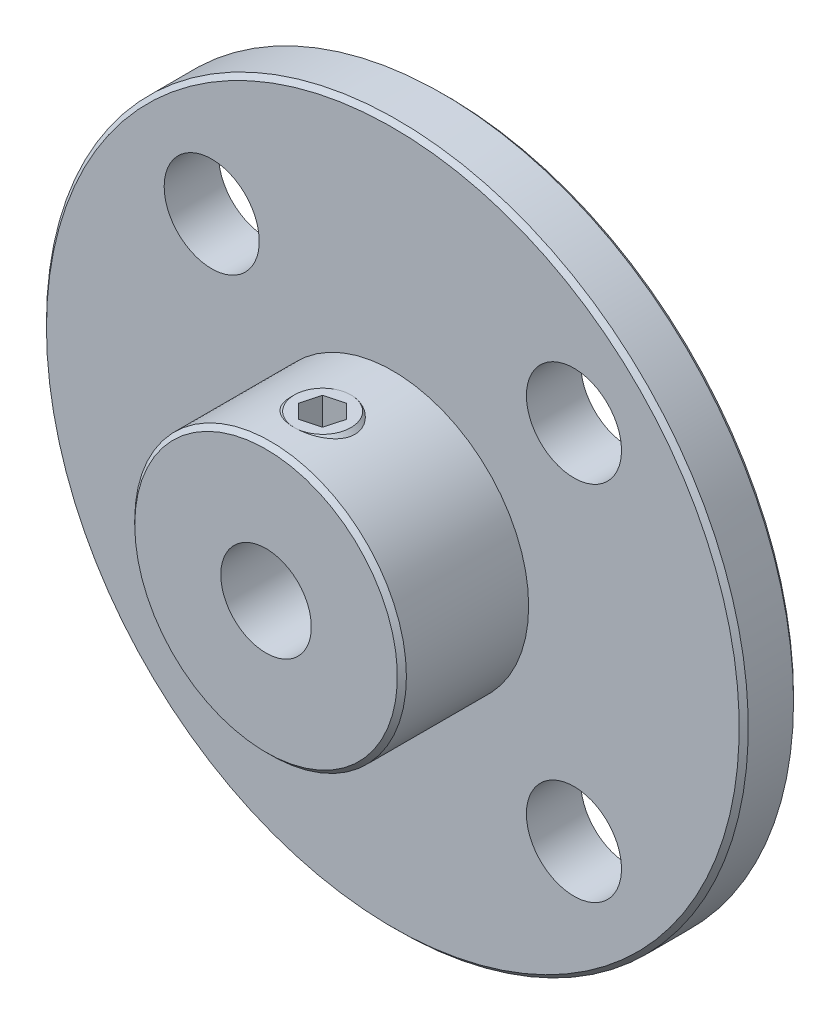
ISO-10303-21;
HEADER;
FILE_DESCRIPTION(('STEP AP214'),'2;1');
FILE_NAME('part.step','',(''),(''),'','','');
FILE_SCHEMA(('AUTOMOTIVE_DESIGN { 1 0 10303 214 1 1 1 1 }'));
ENDSEC;
DATA;
#1=APPLICATION_CONTEXT('core data for automotive mechanical design processes');
#2=APPLICATION_PROTOCOL_DEFINITION('international standard','automotive_design',2000,#1);
#3=PRODUCT_CONTEXT('',#1,'mechanical');
#4=PRODUCT('Part','Part','',(#3));
#5=PRODUCT_RELATED_PRODUCT_CATEGORY('part','',(#4));
#6=PRODUCT_DEFINITION_FORMATION('','',#4);
#7=PRODUCT_DEFINITION_CONTEXT('part definition',#1,'design');
#8=PRODUCT_DEFINITION('design','',#6,#7);
#9=PRODUCT_DEFINITION_SHAPE('','',#8);
#10=(LENGTH_UNIT() NAMED_UNIT(*) SI_UNIT(.MILLI.,.METRE.));
#11=(NAMED_UNIT(*) PLANE_ANGLE_UNIT() SI_UNIT($,.RADIAN.));
#12=(NAMED_UNIT(*) SI_UNIT($,.STERADIAN.) SOLID_ANGLE_UNIT());
#13=UNCERTAINTY_MEASURE_WITH_UNIT(LENGTH_MEASURE(1.E-05),#10,'distance_accuracy_value','');
#14=(GEOMETRIC_REPRESENTATION_CONTEXT(3) GLOBAL_UNCERTAINTY_ASSIGNED_CONTEXT((#13)) GLOBAL_UNIT_ASSIGNED_CONTEXT((#10,
#11,#12)) REPRESENTATION_CONTEXT('',''));
#15=CARTESIAN_POINT('',(0.,0.,0.));
#16=DIRECTION('',(0.,0.,1.));
#17=DIRECTION('',(1.,0.,0.));
#18=AXIS2_PLACEMENT_3D('',#15,#16,#17);
#19=CARTESIAN_POINT('',(0.,6.,5.50000000000001));
#20=DIRECTION('',(0.,-1.,0.));
#21=DIRECTION('',(0.,0.,-1.));
#22=AXIS2_PLACEMENT_3D('',#19,#20,#21);
#23=CYLINDRICAL_SURFACE('',#22,1.5);
#24=CARTESIAN_POINT('',(0.,5.75,5.50000000000001));
#25=DIRECTION('',(0.,1.,0.));
#26=DIRECTION('',(0.,0.,1.));
#27=AXIS2_PLACEMENT_3D('',#24,#25,#26);
#28=CIRCLE('',#27,1.5);
#29=CARTESIAN_POINT('',(0.,5.75,7.00000000000001));
#30=VERTEX_POINT('',#29);
#31=EDGE_CURVE('E12',#30,#30,#28,.F.);
#32=ORIENTED_EDGE('',*,*,#31,.T.);
#33=EDGE_LOOP('',(#32));
#34=FACE_BOUND('',#33,.T.);
#35=CARTESIAN_POINT('',(0.,1.5,5.50000000000001));
#36=DIRECTION('',(0.,1.,0.));
#37=DIRECTION('',(0.,0.,1.));
#38=AXIS2_PLACEMENT_3D('',#35,#36,#37);
#39=CIRCLE('',#38,1.5);
#40=CARTESIAN_POINT('',(0.,1.5,7.00000000000001));
#41=VERTEX_POINT('',#40);
#42=EDGE_CURVE('E150',#41,#41,#39,.T.);
#43=ORIENTED_EDGE('',*,*,#42,.T.);
#44=EDGE_LOOP('',(#43));
#45=FACE_BOUND('',#44,.T.);
#46=ADVANCED_FACE('F48',(#34,#45),#23,.T.);
#47=CARTESIAN_POINT('',(0.,6.,5.50000000000001));
#48=DIRECTION('',(0.,1.,0.));
#49=DIRECTION('',(0.,0.,1.));
#50=AXIS2_PLACEMENT_3D('',#47,#48,#49);
#51=PLANE('',#50);
#52=DIRECTION('',(0.261011592838952,0.,-0.965335666182325));
#53=VECTOR('',#52,1.);
#54=CARTESIAN_POINT('',(0.610980414596356,6.,6.11376129967575));
#55=LINE('',#54,#53);
#56=CARTESIAN_POINT('',(0.610980414596356,6.,6.11376129967575));
#57=VERTEX_POINT('',#56);
#58=CARTESIAN_POINT('',(0.837023084677128,6.,5.27775608958268));
#59=VERTEX_POINT('',#58);
#60=EDGE_CURVE('E63',#57,#59,#55,.T.);
#61=ORIENTED_EDGE('',*,*,#60,.F.);
#62=DIRECTION('',(0.966511006512544,0.,-0.25662516301039));
#63=VECTOR('',#62,1.);
#64=CARTESIAN_POINT('',(-0.226042670080773,6.,6.33600521009307));
#65=LINE('',#64,#63);
#66=CARTESIAN_POINT('',(-0.226042670080773,6.,6.33600521009307));
#67=VERTEX_POINT('',#66);
#68=EDGE_CURVE('E146',#67,#57,#65,.T.);
#69=ORIENTED_EDGE('',*,*,#68,.F.);
#70=DIRECTION('',(0.705499413673592,0.,0.708710503171936));
#71=VECTOR('',#70,1.);
#72=CARTESIAN_POINT('',(-0.83702308467713,6.,5.72224391041733));
#73=LINE('',#72,#71);
#74=CARTESIAN_POINT('',(-0.83702308467713,6.,5.72224391041733));
#75=VERTEX_POINT('',#74);
#76=EDGE_CURVE('E144',#75,#67,#73,.T.);
#77=ORIENTED_EDGE('',*,*,#76,.F.);
#78=DIRECTION('',(-0.261011592838952,0.,0.965335666182325));
#79=VECTOR('',#78,1.);
#80=CARTESIAN_POINT('',(-0.610980414596357,6.,4.88623870032426));
#81=LINE('',#80,#79);
#82=CARTESIAN_POINT('',(-0.610980414596357,6.,4.88623870032426));
#83=VERTEX_POINT('',#82);
#84=EDGE_CURVE('E111',#83,#75,#81,.T.);
#85=ORIENTED_EDGE('',*,*,#84,.F.);
#86=DIRECTION('',(-0.966511006512544,0.,0.256625163010389));
#87=VECTOR('',#86,1.);
#88=CARTESIAN_POINT('',(0.226042670080773,6.,4.66399478990694));
#89=LINE('',#88,#87);
#90=CARTESIAN_POINT('',(0.226042670080773,6.,4.66399478990694));
#91=VERTEX_POINT('',#90);
#92=EDGE_CURVE('E140',#91,#83,#89,.T.);
#93=ORIENTED_EDGE('',*,*,#92,.F.);
#94=DIRECTION('',(-0.705499413673592,0.,-0.708710503171936));
#95=VECTOR('',#94,1.);
#96=CARTESIAN_POINT('',(0.837023084677129,6.,5.27775608958268));
#97=LINE('',#96,#95);
#98=EDGE_CURVE('E137',#59,#91,#97,.T.);
#99=ORIENTED_EDGE('',*,*,#98,.F.);
#100=EDGE_LOOP('',(#61,#69,#77,#85,#93,#99));
#101=FACE_BOUND('',#100,.T.);
#102=CARTESIAN_POINT('',(0.,6.,5.50000000000001));
#103=DIRECTION('',(0.,1.,0.));
#104=DIRECTION('',(0.,0.,1.));
#105=AXIS2_PLACEMENT_3D('',#102,#103,#104);
#106=CIRCLE('',#105,1.25);
#107=CARTESIAN_POINT('',(0.,6.,6.75000000000001));
#108=VERTEX_POINT('',#107);
#109=EDGE_CURVE('E56',#108,#108,#106,.T.);
#110=ORIENTED_EDGE('',*,*,#109,.T.);
#111=EDGE_LOOP('',(#110));
#112=FACE_BOUND('',#111,.T.);
#113=ADVANCED_FACE('F160',(#101,#112),#51,.T.);
#114=CARTESIAN_POINT('',(0.,1.5,5.50000000000001));
#115=DIRECTION('',(0.,1.,0.));
#116=DIRECTION('',(0.,0.,1.));
#117=AXIS2_PLACEMENT_3D('',#114,#115,#116);
#118=PLANE('',#117);
#119=ORIENTED_EDGE('',*,*,#42,.F.);
#120=EDGE_LOOP('',(#119));
#121=FACE_BOUND('',#120,.T.);
#122=ADVANCED_FACE('F164',(#121),#118,.F.);
#123=CARTESIAN_POINT('',(0.,6.,5.50000000000001));
#124=DIRECTION('',(0.,-1.,0.));
#125=DIRECTION('',(0.,0.,-1.));
#126=AXIS2_PLACEMENT_3D('',#123,#124,#125);
#127=CONICAL_SURFACE('',#126,1.25,0.785398163397446);
#128=ORIENTED_EDGE('',*,*,#31,.F.);
#129=EDGE_LOOP('',(#128));
#130=FACE_BOUND('',#129,.T.);
#131=ORIENTED_EDGE('',*,*,#109,.F.);
#132=EDGE_LOOP('',(#131));
#133=FACE_BOUND('',#132,.T.);
#134=ADVANCED_FACE('F50',(#130,#133),#127,.T.);
#135=CARTESIAN_POINT('',(0.610980414596356,4.,6.11376129967575));
#136=DIRECTION('',(0.965335666182325,0.,0.261011592838952));
#137=DIRECTION('',(0.261011592838952,0.,-0.965335666182325));
#138=AXIS2_PLACEMENT_3D('',#135,#136,#137);
#139=PLANE('',#138);
#140=ORIENTED_EDGE('',*,*,#60,.T.);
#141=DIRECTION('',(0.,1.,0.));
#142=VECTOR('',#141,1.);
#143=CARTESIAN_POINT('',(0.837023084677129,4.,5.27775608958268));
#144=LINE('',#143,#142);
#145=CARTESIAN_POINT('',(0.837023084677129,4.,5.27775608958268));
#146=VERTEX_POINT('',#145);
#147=EDGE_CURVE('E93',#146,#59,#144,.T.);
#148=ORIENTED_EDGE('',*,*,#147,.F.);
#149=DIRECTION('',(0.261011592838952,0.,-0.965335666182325));
#150=VECTOR('',#149,1.);
#151=CARTESIAN_POINT('',(0.610980414596356,4.,6.11376129967575));
#152=LINE('',#151,#150);
#153=CARTESIAN_POINT('',(0.610980414596356,4.,6.11376129967575));
#154=VERTEX_POINT('',#153);
#155=EDGE_CURVE('E148',#154,#146,#152,.T.);
#156=ORIENTED_EDGE('',*,*,#155,.F.);
#157=DIRECTION('',(0.,1.,0.));
#158=VECTOR('',#157,1.);
#159=CARTESIAN_POINT('',(0.610980414596356,4.,6.11376129967575));
#160=LINE('',#159,#158);
#161=EDGE_CURVE('E71',#154,#57,#160,.T.);
#162=ORIENTED_EDGE('',*,*,#161,.T.);
#163=EDGE_LOOP('',(#140,#148,#156,#162));
#164=FACE_BOUND('',#163,.T.);
#165=ADVANCED_FACE('F163',(#164),#139,.F.);
#166=CARTESIAN_POINT('',(-0.226042670080773,4.,6.33600521009307));
#167=DIRECTION('',(0.25662516301039,0.,0.966511006512544));
#168=DIRECTION('',(0.966511006512544,0.,-0.25662516301039));
#169=AXIS2_PLACEMENT_3D('',#166,#167,#168);
#170=PLANE('',#169);
#171=ORIENTED_EDGE('',*,*,#68,.T.);
#172=ORIENTED_EDGE('',*,*,#161,.F.);
#173=DIRECTION('',(0.966511006512544,0.,-0.25662516301039));
#174=VECTOR('',#173,1.);
#175=CARTESIAN_POINT('',(-0.226042670080773,4.,6.33600521009307));
#176=LINE('',#175,#174);
#177=CARTESIAN_POINT('',(-0.226042670080773,4.,6.33600521009307));
#178=VERTEX_POINT('',#177);
#179=EDGE_CURVE('E123',#178,#154,#176,.T.);
#180=ORIENTED_EDGE('',*,*,#179,.F.);
#181=DIRECTION('',(0.,1.,0.));
#182=VECTOR('',#181,1.);
#183=CARTESIAN_POINT('',(-0.226042670080773,4.,6.33600521009307));
#184=LINE('',#183,#182);
#185=EDGE_CURVE('E115',#178,#67,#184,.T.);
#186=ORIENTED_EDGE('',*,*,#185,.T.);
#187=EDGE_LOOP('',(#171,#172,#180,#186));
#188=FACE_BOUND('',#187,.T.);
#189=ADVANCED_FACE('F170',(#188),#170,.F.);
#190=CARTESIAN_POINT('',(-0.83702308467713,4.,5.72224391041733));
#191=DIRECTION('',(-0.708710503171936,0.,0.705499413673592));
#192=DIRECTION('',(0.705499413673592,0.,0.708710503171936));
#193=AXIS2_PLACEMENT_3D('',#190,#191,#192);
#194=PLANE('',#193);
#195=ORIENTED_EDGE('',*,*,#76,.T.);
#196=ORIENTED_EDGE('',*,*,#185,.F.);
#197=DIRECTION('',(0.705499413673592,0.,0.708710503171936));
#198=VECTOR('',#197,1.);
#199=CARTESIAN_POINT('',(-0.83702308467713,4.,5.72224391041733));
#200=LINE('',#199,#198);
#201=CARTESIAN_POINT('',(-0.83702308467713,4.,5.72224391041733));
#202=VERTEX_POINT('',#201);
#203=EDGE_CURVE('E119',#202,#178,#200,.T.);
#204=ORIENTED_EDGE('',*,*,#203,.F.);
#205=DIRECTION('',(0.,1.,0.));
#206=VECTOR('',#205,1.);
#207=CARTESIAN_POINT('',(-0.83702308467713,4.,5.72224391041733));
#208=LINE('',#207,#206);
#209=EDGE_CURVE('E104',#202,#75,#208,.T.);
#210=ORIENTED_EDGE('',*,*,#209,.T.);
#211=EDGE_LOOP('',(#195,#196,#204,#210));
#212=FACE_BOUND('',#211,.T.);
#213=ADVANCED_FACE('F120',(#212),#194,.F.);
#214=CARTESIAN_POINT('',(-0.610980414596357,4.,4.88623870032426));
#215=DIRECTION('',(-0.965335666182325,0.,-0.261011592838952));
#216=DIRECTION('',(-0.261011592838952,0.,0.965335666182325));
#217=AXIS2_PLACEMENT_3D('',#214,#215,#216);
#218=PLANE('',#217);
#219=ORIENTED_EDGE('',*,*,#84,.T.);
#220=ORIENTED_EDGE('',*,*,#209,.F.);
#221=DIRECTION('',(-0.261011592838952,0.,0.965335666182325));
#222=VECTOR('',#221,1.);
#223=CARTESIAN_POINT('',(-0.610980414596357,4.,4.88623870032426));
#224=LINE('',#223,#222);
#225=CARTESIAN_POINT('',(-0.610980414596357,4.,4.88623870032426));
#226=VERTEX_POINT('',#225);
#227=EDGE_CURVE('E108',#226,#202,#224,.T.);
#228=ORIENTED_EDGE('',*,*,#227,.F.);
#229=DIRECTION('',(0.,1.,0.));
#230=VECTOR('',#229,1.);
#231=CARTESIAN_POINT('',(-0.610980414596357,4.,4.88623870032426));
#232=LINE('',#231,#230);
#233=EDGE_CURVE('E116',#226,#83,#232,.T.);
#234=ORIENTED_EDGE('',*,*,#233,.T.);
#235=EDGE_LOOP('',(#219,#220,#228,#234));
#236=FACE_BOUND('',#235,.T.);
#237=ADVANCED_FACE('F106',(#236),#218,.F.);
#238=CARTESIAN_POINT('',(0.226042670080773,4.,4.66399478990694));
#239=DIRECTION('',(-0.256625163010389,0.,-0.966511006512544));
#240=DIRECTION('',(-0.966511006512544,0.,0.256625163010389));
#241=AXIS2_PLACEMENT_3D('',#238,#239,#240);
#242=PLANE('',#241);
#243=ORIENTED_EDGE('',*,*,#92,.T.);
#244=ORIENTED_EDGE('',*,*,#233,.F.);
#245=DIRECTION('',(-0.966511006512544,0.,0.256625163010389));
#246=VECTOR('',#245,1.);
#247=CARTESIAN_POINT('',(0.226042670080773,4.,4.66399478990694));
#248=LINE('',#247,#246);
#249=CARTESIAN_POINT('',(0.226042670080773,4.,4.66399478990694));
#250=VERTEX_POINT('',#249);
#251=EDGE_CURVE('E129',#250,#226,#248,.T.);
#252=ORIENTED_EDGE('',*,*,#251,.F.);
#253=DIRECTION('',(0.,1.,0.));
#254=VECTOR('',#253,1.);
#255=CARTESIAN_POINT('',(0.226042670080773,4.,4.66399478990694));
#256=LINE('',#255,#254);
#257=EDGE_CURVE('E153',#250,#91,#256,.T.);
#258=ORIENTED_EDGE('',*,*,#257,.T.);
#259=EDGE_LOOP('',(#243,#244,#252,#258));
#260=FACE_BOUND('',#259,.T.);
#261=ADVANCED_FACE('F187',(#260),#242,.F.);
#262=CARTESIAN_POINT('',(0.837023084677129,4.,5.27775608958268));
#263=DIRECTION('',(0.708710503171936,0.,-0.705499413673592));
#264=DIRECTION('',(-0.705499413673592,0.,-0.708710503171936));
#265=AXIS2_PLACEMENT_3D('',#262,#263,#264);
#266=PLANE('',#265);
#267=ORIENTED_EDGE('',*,*,#98,.T.);
#268=ORIENTED_EDGE('',*,*,#257,.F.);
#269=DIRECTION('',(-0.705499413673592,0.,-0.708710503171936));
#270=VECTOR('',#269,1.);
#271=CARTESIAN_POINT('',(0.837023084677129,4.,5.27775608958268));
#272=LINE('',#271,#270);
#273=EDGE_CURVE('E131',#146,#250,#272,.T.);
#274=ORIENTED_EDGE('',*,*,#273,.F.);
#275=ORIENTED_EDGE('',*,*,#147,.T.);
#276=EDGE_LOOP('',(#267,#268,#274,#275));
#277=FACE_BOUND('',#276,.T.);
#278=ADVANCED_FACE('F184',(#277),#266,.F.);
#279=CARTESIAN_POINT('',(0.,4.,0.));
#280=DIRECTION('',(0.,1.,0.));
#281=DIRECTION('',(0.,0.,1.));
#282=AXIS2_PLACEMENT_3D('',#279,#280,#281);
#283=PLANE('',#282);
#284=ORIENTED_EDGE('',*,*,#155,.T.);
#285=ORIENTED_EDGE('',*,*,#273,.T.);
#286=ORIENTED_EDGE('',*,*,#251,.T.);
#287=ORIENTED_EDGE('',*,*,#227,.T.);
#288=ORIENTED_EDGE('',*,*,#203,.T.);
#289=ORIENTED_EDGE('',*,*,#179,.T.);
#290=EDGE_LOOP('',(#284,#285,#286,#287,#288,#289));
#291=FACE_BOUND('',#290,.T.);
#292=ADVANCED_FACE('F126',(#291),#283,.T.);
#293=CLOSED_SHELL('',(#46,#113,#122,#134,#165,#189,#213,#237,#261,#278,#292));
#294=MANIFOLD_SOLID_BREP('B2',#293);
#295=CARTESIAN_POINT('',(0.,0.,-122.457916377033));
#296=DIRECTION('',(0.,0.,-1.));
#297=DIRECTION('',(-1.,0.,0.));
#298=AXIS2_PLACEMENT_3D('',#295,#296,#297);
#299=CYLINDRICAL_SURFACE('',#298,2.00000000000002);
#300=CARTESIAN_POINT('',(0.,0.,0.));
#301=DIRECTION('',(0.,0.,-1.));
#302=DIRECTION('',(-1.,0.,0.));
#303=AXIS2_PLACEMENT_3D('',#300,#301,#302);
#304=CIRCLE('',#303,2.00000000000002);
#305=CARTESIAN_POINT('',(-2.00000000000002,0.,0.));
#306=VERTEX_POINT('',#305);
#307=EDGE_CURVE('E296',#306,#306,#304,.T.);
#308=ORIENTED_EDGE('',*,*,#307,.T.);
#309=EDGE_LOOP('',(#308));
#310=FACE_BOUND('',#309,.T.);
#311=CARTESIAN_POINT('',(0.,0.,8.00000000000001));
#312=DIRECTION('',(0.,0.,-1.));
#313=DIRECTION('',(-1.,0.,0.));
#314=AXIS2_PLACEMENT_3D('',#311,#312,#313);
#315=CIRCLE('',#314,2.00000000000002);
#316=CARTESIAN_POINT('',(-2.00000000000002,0.,8.00000000000001));
#317=VERTEX_POINT('',#316);
#318=EDGE_CURVE('E391',#317,#317,#315,.T.);
#319=ORIENTED_EDGE('',*,*,#318,.F.);
#320=EDGE_LOOP('',(#319));
#321=FACE_BOUND('',#320,.T.);
#322=CARTESIAN_POINT('',(0.,2.00000000000002,4.25));
#323=CARTESIAN_POINT('',(0.0635104730002027,1.99999595305314,4.25000434999878));
#324=CARTESIAN_POINT('',(0.127096441053758,1.99694323311002,4.25487301181781));
#325=CARTESIAN_POINT('',(0.252318262265283,1.98502167724104,4.27408580342951));
#326=CARTESIAN_POINT('',(0.313950163299074,1.97614175574897,4.28844799392549));
#327=CARTESIAN_POINT('',(0.433205558136783,1.95345852982136,4.32581136316206));
#328=CARTESIAN_POINT('',(0.490847243665017,1.93967960778664,4.34876978784088));
#329=CARTESIAN_POINT('',(0.601260368868361,1.90834598486075,4.40238585079676));
#330=CARTESIAN_POINT('',(0.654032347276154,1.89079170235273,4.4330426360092));
#331=CARTESIAN_POINT('',(0.757974192167975,1.85170152902275,4.50388657318498));
#332=CARTESIAN_POINT('',(0.808679560769979,1.82995962224619,4.54463929997546));
#333=CARTESIAN_POINT('',(0.902986375146761,1.78531349913633,4.63321917450656));
#334=CARTESIAN_POINT('',(0.946578107215735,1.76240774858554,4.68105582825794));
#335=CARTESIAN_POINT('',(1.03142873237133,1.714304186552,4.79003389420452));
#336=CARTESIAN_POINT('',(1.07157206029151,1.68921610993414,4.85209978660728));
#337=CARTESIAN_POINT('',(1.14073966020039,1.64330198128733,4.98356481544719));
#338=CARTESIAN_POINT('',(1.16978270899534,1.6224687599624,5.05295131257609));
#339=CARTESIAN_POINT('',(1.20933400585981,1.59309575627366,5.17881052377872));
#340=CARTESIAN_POINT('',(1.22269552371394,1.58276905990076,5.23396681853882));
#341=CARTESIAN_POINT('',(1.2418184358548,1.56781357325807,5.3463059256108));
#342=CARTESIAN_POINT('',(1.24759056342088,1.56317673673694,5.40348575827449));
#343=CARTESIAN_POINT('',(1.2511891824572,1.56029885782829,5.51841301675113));
#344=CARTESIAN_POINT('',(1.24899483727851,1.5620745877172,5.57616153646241));
#345=CARTESIAN_POINT('',(1.23676317046804,1.57177402383922,5.69031010318897));
#346=CARTESIAN_POINT('',(1.22671956265043,1.57970265767112,5.74670903203909));
#347=CARTESIAN_POINT('',(1.19968103371474,1.60032573121783,5.85543845265749));
#348=CARTESIAN_POINT('',(1.18285016736897,1.61290715104816,5.90783245568428));
#349=CARTESIAN_POINT('',(1.14290189820937,1.64145566443408,6.00916118240543));
#350=CARTESIAN_POINT('',(1.11978227193696,1.65742395501355,6.05809467487451));
#351=CARTESIAN_POINT('',(1.06294892954949,1.69454815993022,6.16083327383275));
#352=CARTESIAN_POINT('',(1.0280629660117,1.71611591575961,6.2138408101204));
#353=CARTESIAN_POINT('',(0.950881463002098,1.76005711791245,6.31383027900049));
#354=CARTESIAN_POINT('',(0.908578308011433,1.78243137335977,6.36080593170653));
#355=CARTESIAN_POINT('',(0.809519713023327,1.82979894916859,6.4553017493704));
#356=CARTESIAN_POINT('',(0.751531353595328,1.85461531676595,6.50163297425884));
#357=CARTESIAN_POINT('',(0.627148099593563,1.90028055062447,6.58385089588726));
#358=CARTESIAN_POINT('',(0.560756523881992,1.92113097514766,6.61974169772894));
#359=CARTESIAN_POINT('',(0.424883562934741,1.95553372961318,6.67776368838143));
#360=CARTESIAN_POINT('',(0.355763457732364,1.96941976591576,6.70053403998119));
#361=CARTESIAN_POINT('',(0.213612154574969,1.9898492931005,6.73376492798282));
#362=CARTESIAN_POINT('',(0.140586648341297,1.99640317990071,6.74424289422201));
#363=CARTESIAN_POINT('',(0.00451561874058143,2.00097840540093,6.7515658500612));
#364=CARTESIAN_POINT('',(-0.058402774163792,2.00012161345512,6.75020317795386));
#365=CARTESIAN_POINT('',(-0.182972117996316,1.99258901494328,6.73811717157928));
#366=CARTESIAN_POINT('',(-0.24462315496274,1.98591360473593,6.72739447490784));
#367=CARTESIAN_POINT('',(-0.362521070658196,1.96774052283071,6.69776146330805));
#368=CARTESIAN_POINT('',(-0.41888500995321,1.95644170526845,6.67918784320335));
#369=CARTESIAN_POINT('',(-0.527638281070995,1.92995684104753,6.63470361072144));
#370=CARTESIAN_POINT('',(-0.580026945470722,1.91477014350268,6.60879176974485));
#371=CARTESIAN_POINT('',(-0.685084056277264,1.87990012356002,6.54748479400452));
#372=CARTESIAN_POINT('',(-0.737246967843411,1.85991764817226,6.51139643076176));
#373=CARTESIAN_POINT('',(-0.835142640217347,1.81806970001718,6.43220613484719));
#374=CARTESIAN_POINT('',(-0.880868151291861,1.79620214826385,6.38909641074546));
#375=CARTESIAN_POINT('',(-0.97147419802289,1.74905869713093,6.28986496058735));
#376=CARTESIAN_POINT('',(-1.01526851939753,1.72374883414958,6.23276279370522));
#377=CARTESIAN_POINT('',(-1.09280351885685,1.67566762748174,6.11112421505574));
#378=CARTESIAN_POINT('',(-1.12655115718694,1.65289453322338,6.04659299324701));
#379=CARTESIAN_POINT('',(-1.17684772011828,1.61733530314594,5.92530785194312));
#380=CARTESIAN_POINT('',(-1.1955189586548,1.60345636193781,5.86975924926778));
#381=CARTESIAN_POINT('',(-1.22500108205245,1.58105030663769,5.75560685423108));
#382=CARTESIAN_POINT('',(-1.23582424983127,1.57251483242607,5.69700799054853));
#383=CARTESIAN_POINT('',(-1.24901383653654,1.56206324988733,5.57790972311931));
#384=CARTESIAN_POINT('',(-1.25133186963293,1.56018501674571,5.51740141451182));
#385=CARTESIAN_POINT('',(-1.24719778716818,1.56349063109849,5.39686903963396));
#386=CARTESIAN_POINT('',(-1.24074275650143,1.56867682595588,5.33684514099048));
#387=CARTESIAN_POINT('',(-1.22038272403399,1.58455388771336,5.22397020494864));
#388=CARTESIAN_POINT('',(-1.2071191949977,1.59476808051062,5.17093069858359));
#389=CARTESIAN_POINT('',(-1.17417623469513,1.61917530435692,5.06786494041409));
#390=CARTESIAN_POINT('',(-1.15449412799407,1.6333699942373,5.01783995546249));
#391=CARTESIAN_POINT('',(-1.10602690439618,1.6666390288652,4.9144032561273));
#392=CARTESIAN_POINT('',(-1.0763364445546,1.68612230498999,4.86154970152344));
#393=CARTESIAN_POINT('',(-1.01000017036389,1.7266770641187,4.76106163275399));
#394=CARTESIAN_POINT('',(-0.973348732866936,1.74774982276827,4.71343138743952));
#395=CARTESIAN_POINT('',(-0.885670221416055,1.79401910731184,4.61498574502215));
#396=CARTESIAN_POINT('',(-0.833233674246788,1.81920541808778,4.56540915455451));
#397=CARTESIAN_POINT('',(-0.719822446025196,1.8669872905675,4.47550517029475));
#398=CARTESIAN_POINT('',(-0.658842515138542,1.88958124364397,4.4351835040726));
#399=CARTESIAN_POINT('',(-0.529355399891399,1.9298671097655,4.3652288698759));
#400=CARTESIAN_POINT('',(-0.460835727056561,1.94755071355358,4.33561399459416));
#401=CARTESIAN_POINT('',(-0.31839471272949,1.97581521637844,4.28892811566826));
#402=CARTESIAN_POINT('',(-0.244493501106841,1.98642121428691,4.27181276513022));
#403=CARTESIAN_POINT('',(-0.141418481224656,1.99519472168145,4.25770079083737));
#404=CARTESIAN_POINT('',(-0.113248608862863,1.99699172226303,4.25481813466603));
#405=CARTESIAN_POINT('',(-0.0567241864870861,1.99939530213241,4.2509667084624));
#406=CARTESIAN_POINT('',(-0.0283696251514509,2.00000180773912,4.24999805689001));
#407=CARTESIAN_POINT('',(0.,2.00000000000002,4.25));
#408=B_SPLINE_CURVE_WITH_KNOTS('',3,(#322,#323,#324,#325,#326,#327,#328,#329,#330,#331,#332,
#333,#334,#335,#336,#337,#338,#339,#340,#341,#342,#343,#344,#345,#346,#347,#348,#349,#350,#351,
#352,#353,#354,#355,#356,#357,#358,#359,#360,#361,#362,#363,#364,#365,#366,#367,#368,#369,#370,
#371,#372,#373,#374,#375,#376,#377,#378,#379,#380,#381,#382,#383,#384,#385,#386,#387,#388,#389,
#390,#391,#392,#393,#394,#395,#396,#397,#398,#399,#400,#401,#402,#403,#404,#405,#406,#407),
.UNSPECIFIED.,.T.,.F.,(4,2,2,2,2,2,2,2,2,2,2,2,2,2,2,2,2,2,2,2,2,2,2,2,2,2,2,2,2,2,2,2,2,2,2,2,
2,2,2,2,2,2,4),(0.,0.190412301434133,0.381187894128463,0.571026987595137,0.760845054038797,
0.965821870536221,1.17107628325702,1.40412975852974,1.63678724607011,1.80912008879717,
1.98120894707391,2.15374823498779,2.32642584505084,2.49515839460437,2.66395067908034,
2.86427450354361,3.06480522575183,3.29842180699523,3.53194640727862,3.7528417413596,
3.97342347958132,4.16127180597574,4.34910733732282,4.52959504531299,4.71011298928468,
4.90885230990554,5.10781368827687,5.33565708863714,5.56334227196912,5.74329940313721,
5.92297427413354,6.10366974688202,6.28442527563865,6.45063169037742,6.61690747313444,
6.8072552303698,6.99775741153771,7.22600539035114,7.45439424578502,7.68316725607079,
7.91112460944409,7.99617501232482,8.08123067890589),.UNSPECIFIED.);
#409=CARTESIAN_POINT('',(0.,2.00000000000002,4.25));
#410=VERTEX_POINT('',#409);
#411=EDGE_CURVE('E320',#410,#410,#408,.T.);
#412=ORIENTED_EDGE('',*,*,#411,.F.);
#413=EDGE_LOOP('',(#412));
#414=FACE_BOUND('',#413,.T.);
#415=ADVANCED_FACE('F268',(#310,#321,#414),#299,.F.);
#416=CARTESIAN_POINT('',(0.,0.,-122.457916377033));
#417=DIRECTION('',(0.,0.,-1.));
#418=DIRECTION('',(-1.,0.,0.));
#419=AXIS2_PLACEMENT_3D('',#416,#417,#418);
#420=CYLINDRICAL_SURFACE('',#419,6.00000000000002);
#421=CARTESIAN_POINT('',(0.,0.,7.8));
#422=DIRECTION('',(0.,0.,-1.));
#423=DIRECTION('',(-1.,0.,0.));
#424=AXIS2_PLACEMENT_3D('',#421,#422,#423);
#425=CIRCLE('',#424,6.00000000000002);
#426=CARTESIAN_POINT('',(-6.00000000000002,0.,7.8));
#427=VERTEX_POINT('',#426);
#428=EDGE_CURVE('E292',#427,#427,#425,.T.);
#429=ORIENTED_EDGE('',*,*,#428,.T.);
#430=EDGE_LOOP('',(#429));
#431=FACE_BOUND('',#430,.T.);
#432=CARTESIAN_POINT('',(0.,0.,2.4));
#433=DIRECTION('',(0.,0.,-1.));
#434=DIRECTION('',(-1.,0.,0.));
#435=AXIS2_PLACEMENT_3D('',#432,#433,#434);
#436=CIRCLE('',#435,6.00000000000002);
#437=CARTESIAN_POINT('',(-6.00000000000002,0.,2.4));
#438=VERTEX_POINT('',#437);
#439=EDGE_CURVE('E343',#438,#438,#436,.T.);
#440=ORIENTED_EDGE('',*,*,#439,.F.);
#441=EDGE_LOOP('',(#440));
#442=FACE_BOUND('',#441,.T.);
#443=CARTESIAN_POINT('',(0.,6.00000000000002,4.25));
#444=CARTESIAN_POINT('',(-0.0694090417016607,5.99999871526653,4.25000247746923));
#445=CARTESIAN_POINT('',(-0.138848789520876,5.99878328775045,4.25580066571875));
#446=CARTESIAN_POINT('',(-0.275761316266994,5.99405200990681,4.27881934953285));
#447=CARTESIAN_POINT('',(-0.343232560128313,5.9905344118925,4.29604852303694));
#448=CARTESIAN_POINT('',(-0.474209132291342,5.98159109196204,4.34137045492182));
#449=CARTESIAN_POINT('',(-0.537718336709185,5.97616727052647,4.36945239599889));
#450=CARTESIAN_POINT('',(-0.659120328605959,5.9639992780986,4.43564960885618));
#451=CARTESIAN_POINT('',(-0.717013367534328,5.95725516625977,4.47376443115583));
#452=CARTESIAN_POINT('',(-0.826390324308838,5.94307700024652,4.55953634019065));
#453=CARTESIAN_POINT('',(-0.877780244162686,5.93563505848533,4.60731200123508));
#454=CARTESIAN_POINT('',(-0.971877776769394,5.9209565769245,4.71079465919511));
#455=CARTESIAN_POINT('',(-1.01458467096099,5.91372005416685,4.76650231187227));
#456=CARTESIAN_POINT('',(-1.09051031677217,5.9001944259531,4.88495196876616));
#457=CARTESIAN_POINT('',(-1.12363054680651,5.8939154517483,4.94775838450275));
#458=CARTESIAN_POINT('',(-1.17881119348064,5.88312840650022,5.07819745177276));
#459=CARTESIAN_POINT('',(-1.20087280167641,5.8786201446757,5.14582958244254));
#460=CARTESIAN_POINT('',(-1.23300240133737,5.87196500986124,5.28298523741564));
#461=CARTESIAN_POINT('',(-1.24323597696799,5.86978556855867,5.35246835933477));
#462=CARTESIAN_POINT('',(-1.25193357655615,5.86793690716492,5.49219684286264));
#463=CARTESIAN_POINT('',(-1.25039890894687,5.86826740800983,5.5624421188653));
#464=CARTESIAN_POINT('',(-1.23573719037197,5.87137174319176,5.70048102797518));
#465=CARTESIAN_POINT('',(-1.2228010523272,5.87410533679902,5.76829597966122));
#466=CARTESIAN_POINT('',(-1.18600543529945,5.88164437615944,5.90077150964493));
#467=CARTESIAN_POINT('',(-1.16214539481382,5.88644992841319,5.96543192560634));
#468=CARTESIAN_POINT('',(-1.10400003213928,5.89763191464104,6.09030722841599));
#469=CARTESIAN_POINT('',(-1.06964002534237,5.90401953785588,6.15048629652708));
#470=CARTESIAN_POINT('',(-0.991522699274819,5.91763890010723,6.26429574426817));
#471=CARTESIAN_POINT('',(-0.947764212262589,5.92487074398539,6.31792530883598));
#472=CARTESIAN_POINT('',(-0.851074921546784,5.9395373092991,6.41821396108038));
#473=CARTESIAN_POINT('',(-0.797981433412083,5.94697323199475,6.46471616889702));
#474=CARTESIAN_POINT('',(-0.684667288611799,5.96108088143003,6.54818044222898));
#475=CARTESIAN_POINT('',(-0.624446525025766,5.96775259670238,6.5851423645984));
#476=CARTESIAN_POINT('',(-0.498405541235478,5.97959870942817,6.64851008153596));
#477=CARTESIAN_POINT('',(-0.4325754619265,5.9847703971026,6.67489680456713));
#478=CARTESIAN_POINT('',(-0.297284620972155,5.99301338211283,6.7161917048355));
#479=CARTESIAN_POINT('',(-0.227824338595089,5.99608495596055,6.73110139323141));
#480=CARTESIAN_POINT('',(-0.0885918657008351,5.99974275215457,6.74879425206789));
#481=CARTESIAN_POINT('',(-0.0188480555261785,6.00037293537581,6.75179194149426));
#482=CARTESIAN_POINT('',(0.120143798757715,5.99919952252776,6.7461550500309));
#483=CARTESIAN_POINT('',(0.189391872962258,5.99739607548155,6.73752118139841));
#484=CARTESIAN_POINT('',(0.324726367119814,5.99158564979186,6.70904434653047));
#485=CARTESIAN_POINT('',(0.390837192894207,5.98760052868079,6.68931251461654));
#486=CARTESIAN_POINT('',(0.518811446661333,5.97787227242396,6.6393221395786));
#487=CARTESIAN_POINT('',(0.580674536336777,5.9721289974458,6.60906275913403));
#488=CARTESIAN_POINT('',(0.699294306943496,5.95941241490716,6.53841962176245));
#489=CARTESIAN_POINT('',(0.755973219469836,5.95242393812332,6.49790807043094));
#490=CARTESIAN_POINT('',(0.861805445886522,5.93802568299711,6.40808043692373));
#491=CARTESIAN_POINT('',(0.910957877913287,5.93061585542513,6.35876332448106));
#492=CARTESIAN_POINT('',(1.0011786486518,5.91606024531379,6.25174442300031));
#493=CARTESIAN_POINT('',(1.04209914600205,5.90892089307503,6.19391696804473));
#494=CARTESIAN_POINT('',(1.11364719079244,5.89585601015807,6.07208371578622));
#495=CARTESIAN_POINT('',(1.14427516677864,5.88993042894653,6.0080781758609));
#496=CARTESIAN_POINT('',(1.19417246443922,5.88001700708043,5.87603880370177));
#497=CARTESIAN_POINT('',(1.21350309828032,5.87601872784689,5.80802896283417));
#498=CARTESIAN_POINT('',(1.24044038523407,5.87039184709699,5.66963344950775));
#499=CARTESIAN_POINT('',(1.24804871544441,5.86876290660369,5.59924811838057));
#500=CARTESIAN_POINT('',(1.25125926487611,5.86807907308508,5.45958659900036));
#501=CARTESIAN_POINT('',(1.24709542622726,5.86897402321504,5.39031592977795));
#502=CARTESIAN_POINT('',(1.22739905314032,5.87312447254929,5.25348599107978));
#503=CARTESIAN_POINT('',(1.21186662782266,5.87637994909628,5.1859267051839));
#504=CARTESIAN_POINT('',(1.16998217768585,5.88486132447718,5.05460222810934));
#505=CARTESIAN_POINT('',(1.14366117568421,5.89008157007932,4.99082675351308));
#506=CARTESIAN_POINT('',(1.08097457299757,5.9019070573874,4.86856122397334));
#507=CARTESIAN_POINT('',(1.0446080398303,5.90851242765462,4.81007166036688));
#508=CARTESIAN_POINT('',(0.962073695342412,5.92251579551148,4.69887837292056));
#509=CARTESIAN_POINT('',(0.915737890418227,5.92992613868406,4.64630087543502));
#510=CARTESIAN_POINT('',(0.814924438115335,5.94461839583215,4.54959050677364));
#511=CARTESIAN_POINT('',(0.760444918832969,5.95190027984881,4.50545958244852));
#512=CARTESIAN_POINT('',(0.644134427507704,5.96561444547639,4.42641142681594));
#513=CARTESIAN_POINT('',(0.582225921521349,5.97203596073246,4.39160632011372));
#514=CARTESIAN_POINT('',(0.453319843998454,5.98319908494094,4.33294977156998));
#515=CARTESIAN_POINT('',(0.386326781907244,5.98794216182103,4.30908875281813));
#516=CARTESIAN_POINT('',(0.266015292900105,5.99432499781445,4.27745972171158));
#517=CARTESIAN_POINT('',(0.213367593727929,5.99644035661397,4.26718123679115));
#518=CARTESIAN_POINT('',(0.107152674176537,5.9992783278976,4.25345054572267));
#519=CARTESIAN_POINT('',(0.0535854878488718,6.00000099184588,4.24999808733281));
#520=CARTESIAN_POINT('',(0.,6.00000000000002,4.25));
#521=B_SPLINE_CURVE_WITH_KNOTS('',3,(#443,#444,#445,#446,#447,#448,#449,#450,#451,#452,#453,
#454,#455,#456,#457,#458,#459,#460,#461,#462,#463,#464,#465,#466,#467,#468,#469,#470,#471,#472,
#473,#474,#475,#476,#477,#478,#479,#480,#481,#482,#483,#484,#485,#486,#487,#488,#489,#490,#491,
#492,#493,#494,#495,#496,#497,#498,#499,#500,#501,#502,#503,#504,#505,#506,#507,#508,#509,#510,
#511,#512,#513,#514,#515,#516,#517,#518,#519,#520),.UNSPECIFIED.,.T.,.F.,(4,2,2,2,2,2,2,2,2,2,2,
2,2,2,2,2,2,2,2,2,2,2,2,2,2,2,2,2,2,2,2,2,2,2,2,2,2,2,4),(0.,0.208031045103183,
0.416220199906226,0.624202378825443,0.832175241572991,1.04287526388123,1.25359271551786,
1.46640449178549,1.67919333285491,1.88896575169855,2.09871484767165,2.3050171212906,
2.5113300003028,2.7191459241675,2.92698768368035,3.13889526355466,3.35080602278218,
3.56309724499663,3.77536051045772,3.98378339407676,4.19219351552278,4.39855286632622,
4.60492863390934,4.81401583995738,5.02312752564575,5.23571263829337,5.4482888985131,
5.65970050095026,5.87108185414186,6.0782922329104,6.28550062281362,6.49211731393256,
6.69875319081481,6.9091902483031,7.11967575117371,7.33258864398257,7.54531486464975,
7.70592588477281,7.86653096973393),.UNSPECIFIED.);
#522=CARTESIAN_POINT('',(0.,6.00000000000002,4.25));
#523=VERTEX_POINT('',#522);
#524=EDGE_CURVE('E313',#523,#523,#521,.T.);
#525=ORIENTED_EDGE('',*,*,#524,.F.);
#526=EDGE_LOOP('',(#525));
#527=FACE_BOUND('',#526,.T.);
#528=ADVANCED_FACE('F322',(#431,#442,#527),#420,.T.);
#529=CARTESIAN_POINT('',(15.5,0.,0.));
#530=DIRECTION('',(0.,0.,1.));
#531=DIRECTION('',(1.,0.,0.));
#532=AXIS2_PLACEMENT_3D('',#529,#530,#531);
#533=PLANE('',#532);
#534=CARTESIAN_POINT('',(0.,0.,0.));
#535=DIRECTION('',(0.,0.,1.));
#536=DIRECTION('',(1.,0.,0.));
#537=AXIS2_PLACEMENT_3D('',#534,#535,#536);
#538=CIRCLE('',#537,15.3);
#539=CARTESIAN_POINT('',(15.3,0.,0.));
#540=VERTEX_POINT('',#539);
#541=EDGE_CURVE('E47',#540,#540,#538,.F.);
#542=ORIENTED_EDGE('',*,*,#541,.T.);
#543=EDGE_LOOP('',(#542));
#544=FACE_BOUND('',#543,.T.);
#545=CARTESIAN_POINT('',(7.99999999999992,8.00000000000009,0.));
#546=DIRECTION('',(0.,0.,-1.));
#547=DIRECTION('',(0.,1.,0.));
#548=AXIS2_PLACEMENT_3D('',#545,#546,#547);
#549=CIRCLE('',#548,2.1);
#550=CARTESIAN_POINT('',(7.9999999999999,10.1000000000001,0.));
#551=VERTEX_POINT('',#550);
#552=EDGE_CURVE('E301',#551,#551,#549,.T.);
#553=ORIENTED_EDGE('',*,*,#552,.F.);
#554=EDGE_LOOP('',(#553));
#555=FACE_BOUND('',#554,.T.);
#556=CARTESIAN_POINT('',(8.,-8.00000000000001,0.));
#557=DIRECTION('',(0.,0.,-1.));
#558=DIRECTION('',(1.,0.,0.));
#559=AXIS2_PLACEMENT_3D('',#556,#557,#558);
#560=CIRCLE('',#559,2.1);
#561=CARTESIAN_POINT('',(10.1,-8.00000000000001,0.));
#562=VERTEX_POINT('',#561);
#563=EDGE_CURVE('E300',#562,#562,#560,.T.);
#564=ORIENTED_EDGE('',*,*,#563,.F.);
#565=EDGE_LOOP('',(#564));
#566=FACE_BOUND('',#565,.T.);
#567=CARTESIAN_POINT('',(-7.99999999999998,-8.00000000000003,0.));
#568=DIRECTION('',(0.,0.,-1.));
#569=DIRECTION('',(0.,-1.,0.));
#570=AXIS2_PLACEMENT_3D('',#567,#568,#569);
#571=CIRCLE('',#570,2.1);
#572=CARTESIAN_POINT('',(-7.99999999999997,-10.1,0.));
#573=VERTEX_POINT('',#572);
#574=EDGE_CURVE('E305',#573,#573,#571,.T.);
#575=ORIENTED_EDGE('',*,*,#574,.F.);
#576=EDGE_LOOP('',(#575));
#577=FACE_BOUND('',#576,.T.);
#578=CARTESIAN_POINT('',(-8.,8.00000000000001,0.));
#579=DIRECTION('',(0.,0.,-1.));
#580=DIRECTION('',(-1.,0.,0.));
#581=AXIS2_PLACEMENT_3D('',#578,#579,#580);
#582=CIRCLE('',#581,2.1);
#583=CARTESIAN_POINT('',(-10.1,8.00000000000001,0.));
#584=VERTEX_POINT('',#583);
#585=EDGE_CURVE('E309',#584,#584,#582,.T.);
#586=ORIENTED_EDGE('',*,*,#585,.F.);
#587=EDGE_LOOP('',(#586));
#588=FACE_BOUND('',#587,.T.);
#589=ORIENTED_EDGE('',*,*,#307,.F.);
#590=EDGE_LOOP('',(#589));
#591=FACE_BOUND('',#590,.T.);
#592=ADVANCED_FACE('F350',(#544,#555,#566,#577,#588,#591),#533,.F.);
#593=CARTESIAN_POINT('',(2.00000000000002,0.,8.));
#594=DIRECTION('',(0.,0.,-1.));
#595=DIRECTION('',(-1.,0.,0.));
#596=AXIS2_PLACEMENT_3D('',#593,#594,#595);
#597=PLANE('',#596);
#598=CARTESIAN_POINT('',(0.,0.,8.));
#599=DIRECTION('',(0.,0.,-1.));
#600=DIRECTION('',(-1.,0.,0.));
#601=AXIS2_PLACEMENT_3D('',#598,#599,#600);
#602=CIRCLE('',#601,5.80000000000003);
#603=CARTESIAN_POINT('',(-5.80000000000003,0.,8.));
#604=VERTEX_POINT('',#603);
#605=EDGE_CURVE('E288',#604,#604,#602,.F.);
#606=ORIENTED_EDGE('',*,*,#605,.T.);
#607=EDGE_LOOP('',(#606));
#608=FACE_BOUND('',#607,.T.);
#609=ORIENTED_EDGE('',*,*,#318,.T.);
#610=EDGE_LOOP('',(#609));
#611=FACE_BOUND('',#610,.T.);
#612=ADVANCED_FACE('F349',(#608,#611),#597,.F.);
#613=CARTESIAN_POINT('',(6.00000000000002,0.,2.4));
#614=DIRECTION('',(0.,0.,-1.));
#615=DIRECTION('',(-1.,0.,0.));
#616=AXIS2_PLACEMENT_3D('',#613,#614,#615);
#617=PLANE('',#616);
#618=CARTESIAN_POINT('',(0.,0.,2.4));
#619=DIRECTION('',(0.,0.,-1.));
#620=DIRECTION('',(-1.,0.,0.));
#621=AXIS2_PLACEMENT_3D('',#618,#619,#620);
#622=CIRCLE('',#621,15.3);
#623=CARTESIAN_POINT('',(-15.3,0.,2.4));
#624=VERTEX_POINT('',#623);
#625=EDGE_CURVE('E275',#624,#624,#622,.F.);
#626=ORIENTED_EDGE('',*,*,#625,.T.);
#627=EDGE_LOOP('',(#626));
#628=FACE_BOUND('',#627,.T.);
#629=CARTESIAN_POINT('',(7.99999999999992,8.00000000000009,2.4));
#630=DIRECTION('',(0.,0.,-1.));
#631=DIRECTION('',(-1.,0.,0.));
#632=AXIS2_PLACEMENT_3D('',#629,#630,#631);
#633=CIRCLE('',#632,2.1);
#634=CARTESIAN_POINT('',(5.89999999999992,8.00000000000009,2.4));
#635=VERTEX_POINT('',#634);
#636=EDGE_CURVE('E297',#635,#635,#633,.T.);
#637=ORIENTED_EDGE('',*,*,#636,.T.);
#638=EDGE_LOOP('',(#637));
#639=FACE_BOUND('',#638,.T.);
#640=CARTESIAN_POINT('',(8.,-8.00000000000001,2.4));
#641=DIRECTION('',(0.,0.,-1.));
#642=DIRECTION('',(-1.,0.,0.));
#643=AXIS2_PLACEMENT_3D('',#640,#641,#642);
#644=CIRCLE('',#643,2.1);
#645=CARTESIAN_POINT('',(5.9,-8.00000000000001,2.4));
#646=VERTEX_POINT('',#645);
#647=EDGE_CURVE('E302',#646,#646,#644,.T.);
#648=ORIENTED_EDGE('',*,*,#647,.T.);
#649=EDGE_LOOP('',(#648));
#650=FACE_BOUND('',#649,.T.);
#651=CARTESIAN_POINT('',(-7.99999999999998,-8.00000000000003,2.4));
#652=DIRECTION('',(0.,0.,-1.));
#653=DIRECTION('',(-1.,0.,0.));
#654=AXIS2_PLACEMENT_3D('',#651,#652,#653);
#655=CIRCLE('',#654,2.1);
#656=CARTESIAN_POINT('',(-10.1,-8.00000000000003,2.4));
#657=VERTEX_POINT('',#656);
#658=EDGE_CURVE('E306',#657,#657,#655,.T.);
#659=ORIENTED_EDGE('',*,*,#658,.T.);
#660=EDGE_LOOP('',(#659));
#661=FACE_BOUND('',#660,.T.);
#662=CARTESIAN_POINT('',(-8.,8.00000000000001,2.4));
#663=DIRECTION('',(0.,0.,-1.));
#664=DIRECTION('',(-1.,0.,0.));
#665=AXIS2_PLACEMENT_3D('',#662,#663,#664);
#666=CIRCLE('',#665,2.1);
#667=CARTESIAN_POINT('',(-10.1,8.00000000000001,2.4));
#668=VERTEX_POINT('',#667);
#669=EDGE_CURVE('E310',#668,#668,#666,.T.);
#670=ORIENTED_EDGE('',*,*,#669,.T.);
#671=EDGE_LOOP('',(#670));
#672=FACE_BOUND('',#671,.T.);
#673=ORIENTED_EDGE('',*,*,#439,.T.);
#674=EDGE_LOOP('',(#673));
#675=FACE_BOUND('',#674,.T.);
#676=ADVANCED_FACE('F369',(#628,#639,#650,#661,#672,#675),#617,.F.);
#677=CARTESIAN_POINT('',(0.,0.,-122.457916377033));
#678=DIRECTION('',(0.,0.,-1.));
#679=DIRECTION('',(-1.,0.,0.));
#680=AXIS2_PLACEMENT_3D('',#677,#678,#679);
#681=CYLINDRICAL_SURFACE('',#680,15.5);
#682=CARTESIAN_POINT('',(0.,0.,2.20000000000001));
#683=DIRECTION('',(0.,0.,-1.));
#684=DIRECTION('',(-1.,0.,0.));
#685=AXIS2_PLACEMENT_3D('',#682,#683,#684);
#686=CIRCLE('',#685,15.5);
#687=CARTESIAN_POINT('',(-15.5,0.,2.20000000000001));
#688=VERTEX_POINT('',#687);
#689=EDGE_CURVE('E279',#688,#688,#686,.T.);
#690=ORIENTED_EDGE('',*,*,#689,.T.);
#691=EDGE_LOOP('',(#690));
#692=FACE_BOUND('',#691,.T.);
#693=CARTESIAN_POINT('',(0.,0.,0.199999999999978));
#694=DIRECTION('',(0.,0.,1.));
#695=DIRECTION('',(1.,0.,0.));
#696=AXIS2_PLACEMENT_3D('',#693,#694,#695);
#697=CIRCLE('',#696,15.5);
#698=CARTESIAN_POINT('',(15.5,0.,0.199999999999978));
#699=VERTEX_POINT('',#698);
#700=EDGE_CURVE('E283',#699,#699,#697,.T.);
#701=ORIENTED_EDGE('',*,*,#700,.T.);
#702=EDGE_LOOP('',(#701));
#703=FACE_BOUND('',#702,.T.);
#704=ADVANCED_FACE('F332',(#692,#703),#681,.T.);
#705=CARTESIAN_POINT('',(0.,15.5,5.50000000000001));
#706=DIRECTION('',(0.,-1.,0.));
#707=DIRECTION('',(0.,0.,-1.));
#708=AXIS2_PLACEMENT_3D('',#705,#706,#707);
#709=CYLINDRICAL_SURFACE('',#708,1.25);
#710=ORIENTED_EDGE('',*,*,#524,.T.);
#711=EDGE_LOOP('',(#710));
#712=FACE_BOUND('',#711,.T.);
#713=ORIENTED_EDGE('',*,*,#411,.T.);
#714=EDGE_LOOP('',(#713));
#715=FACE_BOUND('',#714,.T.);
#716=ADVANCED_FACE('F326',(#712,#715),#709,.F.);
#717=CARTESIAN_POINT('',(-8.,8.00000000000001,8.00000000000001));
#718=DIRECTION('',(0.,0.,-1.));
#719=DIRECTION('',(-1.,0.,0.));
#720=AXIS2_PLACEMENT_3D('',#717,#718,#719);
#721=CYLINDRICAL_SURFACE('',#720,2.1);
#722=ORIENTED_EDGE('',*,*,#585,.T.);
#723=EDGE_LOOP('',(#722));
#724=FACE_BOUND('',#723,.T.);
#725=ORIENTED_EDGE('',*,*,#669,.F.);
#726=EDGE_LOOP('',(#725));
#727=FACE_BOUND('',#726,.T.);
#728=ADVANCED_FACE('F331',(#724,#727),#721,.F.);
#729=CARTESIAN_POINT('',(-7.99999999999998,-8.00000000000003,8.00000000000001));
#730=DIRECTION('',(0.,0.,-1.));
#731=DIRECTION('',(-1.,0.,0.));
#732=AXIS2_PLACEMENT_3D('',#729,#730,#731);
#733=CYLINDRICAL_SURFACE('',#732,2.1);
#734=ORIENTED_EDGE('',*,*,#574,.T.);
#735=EDGE_LOOP('',(#734));
#736=FACE_BOUND('',#735,.T.);
#737=ORIENTED_EDGE('',*,*,#658,.F.);
#738=EDGE_LOOP('',(#737));
#739=FACE_BOUND('',#738,.T.);
#740=ADVANCED_FACE('F462',(#736,#739),#733,.F.);
#741=CARTESIAN_POINT('',(8.,-8.00000000000001,8.00000000000001));
#742=DIRECTION('',(0.,0.,-1.));
#743=DIRECTION('',(-1.,0.,0.));
#744=AXIS2_PLACEMENT_3D('',#741,#742,#743);
#745=CYLINDRICAL_SURFACE('',#744,2.1);
#746=ORIENTED_EDGE('',*,*,#563,.T.);
#747=EDGE_LOOP('',(#746));
#748=FACE_BOUND('',#747,.T.);
#749=ORIENTED_EDGE('',*,*,#647,.F.);
#750=EDGE_LOOP('',(#749));
#751=FACE_BOUND('',#750,.T.);
#752=ADVANCED_FACE('F455',(#748,#751),#745,.F.);
#753=CARTESIAN_POINT('',(7.99999999999992,8.00000000000009,8.00000000000001));
#754=DIRECTION('',(0.,0.,-1.));
#755=DIRECTION('',(-1.,0.,0.));
#756=AXIS2_PLACEMENT_3D('',#753,#754,#755);
#757=CYLINDRICAL_SURFACE('',#756,2.1);
#758=ORIENTED_EDGE('',*,*,#552,.T.);
#759=EDGE_LOOP('',(#758));
#760=FACE_BOUND('',#759,.T.);
#761=ORIENTED_EDGE('',*,*,#636,.F.);
#762=EDGE_LOOP('',(#761));
#763=FACE_BOUND('',#762,.T.);
#764=ADVANCED_FACE('F356',(#760,#763),#757,.F.);
#765=CARTESIAN_POINT('',(0.,0.,7.8));
#766=DIRECTION('',(0.,0.,-1.));
#767=DIRECTION('',(-1.,0.,0.));
#768=AXIS2_PLACEMENT_3D('',#765,#766,#767);
#769=CONICAL_SURFACE('',#768,6.00000000000002,0.785398163397414);
#770=ORIENTED_EDGE('',*,*,#605,.F.);
#771=EDGE_LOOP('',(#770));
#772=FACE_BOUND('',#771,.T.);
#773=ORIENTED_EDGE('',*,*,#428,.F.);
#774=EDGE_LOOP('',(#773));
#775=FACE_BOUND('',#774,.T.);
#776=ADVANCED_FACE('F353',(#772,#775),#769,.T.);
#777=CARTESIAN_POINT('',(0.,0.,2.20000000000001));
#778=DIRECTION('',(0.,0.,-1.));
#779=DIRECTION('',(-1.,0.,0.));
#780=AXIS2_PLACEMENT_3D('',#777,#778,#779);
#781=CONICAL_SURFACE('',#780,15.5,0.785398163397474);
#782=ORIENTED_EDGE('',*,*,#625,.F.);
#783=EDGE_LOOP('',(#782));
#784=FACE_BOUND('',#783,.T.);
#785=ORIENTED_EDGE('',*,*,#689,.F.);
#786=EDGE_LOOP('',(#785));
#787=FACE_BOUND('',#786,.T.);
#788=ADVANCED_FACE('F355',(#784,#787),#781,.T.);
#789=CARTESIAN_POINT('',(0.,0.,0.));
#790=DIRECTION('',(0.,0.,1.));
#791=DIRECTION('',(1.,0.,0.));
#792=AXIS2_PLACEMENT_3D('',#789,#790,#791);
#793=CONICAL_SURFACE('',#792,15.3,0.785398163397474);
#794=ORIENTED_EDGE('',*,*,#700,.F.);
#795=EDGE_LOOP('',(#794));
#796=FACE_BOUND('',#795,.T.);
#797=ORIENTED_EDGE('',*,*,#541,.F.);
#798=EDGE_LOOP('',(#797));
#799=FACE_BOUND('',#798,.T.);
#800=ADVANCED_FACE('F270',(#796,#799),#793,.T.);
#801=CLOSED_SHELL('',(#415,#528,#592,#612,#676,#704,#716,#728,#740,#752,#764,#776,#788,#800));
#802=MANIFOLD_SOLID_BREP('B6',#801);
#803=ADVANCED_BREP_SHAPE_REPRESENTATION('',(#18,#294,#802),#14);
#804=SHAPE_DEFINITION_REPRESENTATION(#9,#803);
ENDSEC;
END-ISO-10303-21;
